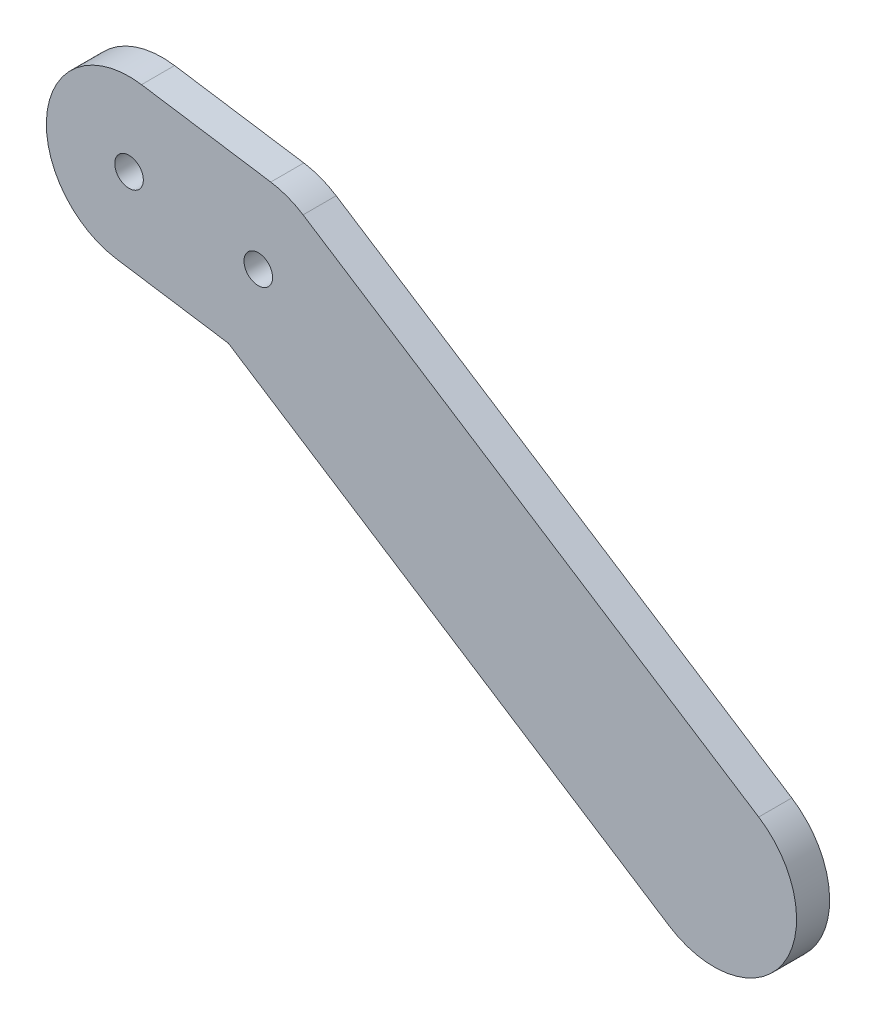
ISO-10303-21;
HEADER;
FILE_DESCRIPTION(('STEP AP214'),'2;1');
FILE_NAME('part.step','',(''),(''),'','','');
FILE_SCHEMA(('AUTOMOTIVE_DESIGN { 1 0 10303 214 1 1 1 1 }'));
ENDSEC;
DATA;
#1=APPLICATION_CONTEXT('core data for automotive mechanical design processes');
#2=APPLICATION_PROTOCOL_DEFINITION('international standard','automotive_design',2000,#1);
#3=PRODUCT_CONTEXT('',#1,'mechanical');
#4=PRODUCT('Part','Part','',(#3));
#5=PRODUCT_RELATED_PRODUCT_CATEGORY('part','',(#4));
#6=PRODUCT_DEFINITION_FORMATION('','',#4);
#7=PRODUCT_DEFINITION_CONTEXT('part definition',#1,'design');
#8=PRODUCT_DEFINITION('design','',#6,#7);
#9=PRODUCT_DEFINITION_SHAPE('','',#8);
#10=(LENGTH_UNIT() NAMED_UNIT(*) SI_UNIT(.MILLI.,.METRE.));
#11=(NAMED_UNIT(*) PLANE_ANGLE_UNIT() SI_UNIT($,.RADIAN.));
#12=(NAMED_UNIT(*) SI_UNIT($,.STERADIAN.) SOLID_ANGLE_UNIT());
#13=UNCERTAINTY_MEASURE_WITH_UNIT(LENGTH_MEASURE(1.E-05),#10,'distance_accuracy_value','');
#14=(GEOMETRIC_REPRESENTATION_CONTEXT(3) GLOBAL_UNCERTAINTY_ASSIGNED_CONTEXT((#13)) GLOBAL_UNIT_ASSIGNED_CONTEXT((#10,
#11,#12)) REPRESENTATION_CONTEXT('',''));
#15=CARTESIAN_POINT('',(0.,0.,0.));
#16=DIRECTION('',(0.,0.,1.));
#17=DIRECTION('',(1.,0.,0.));
#18=AXIS2_PLACEMENT_3D('',#15,#16,#17);
#19=CARTESIAN_POINT('',(5.41813515557909,8.40498729540258,2.));
#20=DIRECTION('',(0.541813515557907,0.840498729540255,0.));
#21=DIRECTION('',(-0.840498729540255,0.541813515557907,0.));
#22=AXIS2_PLACEMENT_3D('',#19,#20,#21);
#23=PLANE('',#22);
#24=DIRECTION('',(0.840498729540255,-0.541813515557907,0.));
#25=VECTOR('',#24,1.);
#26=CARTESIAN_POINT('',(5.41813515557909,8.40498729540258,-2.));
#27=LINE('',#26,#25);
#28=CARTESIAN_POINT('',(5.41813515557906,8.40498729540257,-2.));
#29=VERTEX_POINT('',#28);
#30=CARTESIAN_POINT('',(60.5224452158877,-27.1170889515179,-2.));
#31=VERTEX_POINT('',#30);
#32=EDGE_CURVE('E128',#29,#31,#27,.T.);
#33=ORIENTED_EDGE('',*,*,#32,.F.);
#34=DIRECTION('',(0.,0.,-1.));
#35=VECTOR('',#34,1.);
#36=CARTESIAN_POINT('',(5.41813515557906,8.40498729540257,2.));
#37=LINE('',#36,#35);
#38=CARTESIAN_POINT('',(5.41813515557906,8.40498729540257,2.));
#39=VERTEX_POINT('',#38);
#40=EDGE_CURVE('E11',#39,#29,#37,.T.);
#41=ORIENTED_EDGE('',*,*,#40,.F.);
#42=DIRECTION('',(0.840498729540255,-0.541813515557907,0.));
#43=VECTOR('',#42,1.);
#44=CARTESIAN_POINT('',(5.41813515557909,8.40498729540258,2.));
#45=LINE('',#44,#43);
#46=CARTESIAN_POINT('',(60.5224452158877,-27.1170889515179,2.));
#47=VERTEX_POINT('',#46);
#48=EDGE_CURVE('E148',#39,#47,#45,.T.);
#49=ORIENTED_EDGE('',*,*,#48,.T.);
#50=DIRECTION('',(0.,0.,-1.));
#51=VECTOR('',#50,1.);
#52=CARTESIAN_POINT('',(60.5224452158877,-27.1170889515179,2.));
#53=LINE('',#52,#51);
#54=EDGE_CURVE('E80',#47,#31,#53,.T.);
#55=ORIENTED_EDGE('',*,*,#54,.T.);
#56=EDGE_LOOP('',(#33,#41,#49,#55));
#57=FACE_BOUND('',#56,.T.);
#58=ADVANCED_FACE('F33',(#57),#23,.T.);
#59=CARTESIAN_POINT('',(0.,0.,2.));
#60=DIRECTION('',(0.,0.,-1.));
#61=DIRECTION('',(-1.,0.,0.));
#62=AXIS2_PLACEMENT_3D('',#59,#60,#61);
#63=CYLINDRICAL_SURFACE('',#62,10.);
#64=CARTESIAN_POINT('',(0.,0.,-2.));
#65=DIRECTION('',(0.,0.,1.));
#66=DIRECTION('',(1.,0.,0.));
#67=AXIS2_PLACEMENT_3D('',#64,#65,#66);
#68=CIRCLE('',#67,10.);
#69=CARTESIAN_POINT('',(1.50792779806708,9.885653936681,-2.));
#70=VERTEX_POINT('',#69);
#71=EDGE_CURVE('E131',#29,#70,#68,.T.);
#72=ORIENTED_EDGE('',*,*,#71,.T.);
#73=DIRECTION('',(0.,0.,-1.));
#74=VECTOR('',#73,1.);
#75=CARTESIAN_POINT('',(1.50792779806708,9.885653936681,2.));
#76=LINE('',#75,#74);
#77=CARTESIAN_POINT('',(1.50792779806708,9.885653936681,2.));
#78=VERTEX_POINT('',#77);
#79=EDGE_CURVE('E41',#78,#70,#76,.T.);
#80=ORIENTED_EDGE('',*,*,#79,.F.);
#81=CARTESIAN_POINT('',(0.,0.,2.));
#82=DIRECTION('',(0.,0.,1.));
#83=DIRECTION('',(1.,0.,0.));
#84=AXIS2_PLACEMENT_3D('',#81,#82,#83);
#85=CIRCLE('',#84,10.);
#86=EDGE_CURVE('E185',#39,#78,#85,.T.);
#87=ORIENTED_EDGE('',*,*,#86,.F.);
#88=ORIENTED_EDGE('',*,*,#40,.T.);
#89=EDGE_LOOP('',(#72,#80,#87,#88));
#90=FACE_BOUND('',#89,.T.);
#91=ADVANCED_FACE('F176',(#90),#63,.T.);
#92=CARTESIAN_POINT('',(1.50792779806711,9.885653936681,2.));
#93=DIRECTION('',(-0.150792779806711,-0.9885653936681,0.));
#94=DIRECTION('',(0.9885653936681,-0.150792779806711,0.));
#95=AXIS2_PLACEMENT_3D('',#92,#93,#94);
#96=PLANE('',#95);
#97=DIRECTION('',(-0.9885653936681,0.150792779806711,0.));
#98=VECTOR('',#97,1.);
#99=CARTESIAN_POINT('',(1.50792779806711,9.885653936681,-2.));
#100=LINE('',#99,#98);
#101=CARTESIAN_POINT('',(-14.125378827349,12.270311318698,-2.));
#102=VERTEX_POINT('',#101);
#103=EDGE_CURVE('E133',#70,#102,#100,.T.);
#104=ORIENTED_EDGE('',*,*,#103,.T.);
#105=DIRECTION('',(0.,0.,-1.));
#106=VECTOR('',#105,1.);
#107=CARTESIAN_POINT('',(-14.125378827349,12.270311318698,2.));
#108=LINE('',#107,#106);
#109=CARTESIAN_POINT('',(-14.125378827349,12.270311318698,2.));
#110=VERTEX_POINT('',#109);
#111=EDGE_CURVE('E152',#110,#102,#108,.T.);
#112=ORIENTED_EDGE('',*,*,#111,.F.);
#113=DIRECTION('',(-0.9885653936681,0.150792779806711,0.));
#114=VECTOR('',#113,1.);
#115=CARTESIAN_POINT('',(1.50792779806711,9.885653936681,2.));
#116=LINE('',#115,#114);
#117=EDGE_CURVE('E117',#78,#110,#116,.T.);
#118=ORIENTED_EDGE('',*,*,#117,.F.);
#119=ORIENTED_EDGE('',*,*,#79,.T.);
#120=EDGE_LOOP('',(#104,#112,#118,#119));
#121=FACE_BOUND('',#120,.T.);
#122=ADVANCED_FACE('F159',(#121),#96,.F.);
#123=CARTESIAN_POINT('',(-15.6333066254161,2.38465738201698,2.));
#124=DIRECTION('',(0.,0.,-1.));
#125=DIRECTION('',(-1.,0.,0.));
#126=AXIS2_PLACEMENT_3D('',#123,#124,#125);
#127=CYLINDRICAL_SURFACE('',#126,10.);
#128=CARTESIAN_POINT('',(-15.6333066254161,2.38465738201698,-2.));
#129=DIRECTION('',(0.,0.,1.));
#130=DIRECTION('',(1.,0.,0.));
#131=AXIS2_PLACEMENT_3D('',#128,#129,#130);
#132=CIRCLE('',#131,10.);
#133=CARTESIAN_POINT('',(-17.1412344234832,-7.50099655466402,-2.));
#134=VERTEX_POINT('',#133);
#135=EDGE_CURVE('E135',#102,#134,#132,.T.);
#136=ORIENTED_EDGE('',*,*,#135,.T.);
#137=DIRECTION('',(0.,0.,-1.));
#138=VECTOR('',#137,1.);
#139=CARTESIAN_POINT('',(-17.1412344234832,-7.50099655466402,2.));
#140=LINE('',#139,#138);
#141=CARTESIAN_POINT('',(-17.1412344234832,-7.50099655466402,2.));
#142=VERTEX_POINT('',#141);
#143=EDGE_CURVE('E105',#142,#134,#140,.T.);
#144=ORIENTED_EDGE('',*,*,#143,.F.);
#145=CARTESIAN_POINT('',(-15.6333066254161,2.38465738201698,2.));
#146=DIRECTION('',(0.,0.,1.));
#147=DIRECTION('',(1.,0.,0.));
#148=AXIS2_PLACEMENT_3D('',#145,#146,#147);
#149=CIRCLE('',#148,10.);
#150=EDGE_CURVE('E114',#110,#142,#149,.T.);
#151=ORIENTED_EDGE('',*,*,#150,.F.);
#152=ORIENTED_EDGE('',*,*,#111,.T.);
#153=EDGE_LOOP('',(#136,#144,#151,#152));
#154=FACE_BOUND('',#153,.T.);
#155=ADVANCED_FACE('F168',(#154),#127,.T.);
#156=CARTESIAN_POINT('',(-1.50792779806711,-9.885653936681,2.));
#157=DIRECTION('',(-0.150792779806711,-0.9885653936681,0.));
#158=DIRECTION('',(0.9885653936681,-0.150792779806711,0.));
#159=AXIS2_PLACEMENT_3D('',#156,#157,#158);
#160=PLANE('',#159);
#161=DIRECTION('',(-0.9885653936681,0.150792779806711,0.));
#162=VECTOR('',#161,1.);
#163=CARTESIAN_POINT('',(-1.50792779806711,-9.885653936681,-2.));
#164=LINE('',#163,#162);
#165=CARTESIAN_POINT('',(-3.62130131332809,-9.56328632278588,-2.));
#166=VERTEX_POINT('',#165);
#167=EDGE_CURVE('E104',#166,#134,#164,.T.);
#168=ORIENTED_EDGE('',*,*,#167,.F.);
#169=DIRECTION('',(0.,0.,-1.));
#170=VECTOR('',#169,1.);
#171=CARTESIAN_POINT('',(-3.62130131332809,-9.56328632278588,2.));
#172=LINE('',#171,#170);
#173=CARTESIAN_POINT('',(-3.62130131332809,-9.56328632278588,2.));
#174=VERTEX_POINT('',#173);
#175=EDGE_CURVE('E98',#174,#166,#172,.T.);
#176=ORIENTED_EDGE('',*,*,#175,.F.);
#177=DIRECTION('',(-0.9885653936681,0.150792779806711,0.));
#178=VECTOR('',#177,1.);
#179=CARTESIAN_POINT('',(-1.50792779806711,-9.885653936681,2.));
#180=LINE('',#179,#178);
#181=EDGE_CURVE('E102',#174,#142,#180,.T.);
#182=ORIENTED_EDGE('',*,*,#181,.T.);
#183=ORIENTED_EDGE('',*,*,#143,.T.);
#184=EDGE_LOOP('',(#168,#176,#182,#183));
#185=FACE_BOUND('',#184,.T.);
#186=ADVANCED_FACE('F100',(#185),#160,.T.);
#187=CARTESIAN_POINT('',(-5.41813515557905,-8.40498729540253,2.));
#188=DIRECTION('',(0.541813515557907,0.840498729540255,0.));
#189=DIRECTION('',(-0.840498729540255,0.541813515557907,0.));
#190=AXIS2_PLACEMENT_3D('',#187,#188,#189);
#191=PLANE('',#190);
#192=DIRECTION('',(0.840498729540255,-0.541813515557907,0.));
#193=VECTOR('',#192,1.);
#194=CARTESIAN_POINT('',(-5.41813515557905,-8.40498729540253,-2.));
#195=LINE('',#194,#193);
#196=CARTESIAN_POINT('',(49.6861749047295,-43.927063542323,-2.));
#197=VERTEX_POINT('',#196);
#198=EDGE_CURVE('E73',#166,#197,#195,.T.);
#199=ORIENTED_EDGE('',*,*,#198,.T.);
#200=DIRECTION('',(0.,0.,-1.));
#201=VECTOR('',#200,1.);
#202=CARTESIAN_POINT('',(49.6861749047295,-43.927063542323,2.));
#203=LINE('',#202,#201);
#204=CARTESIAN_POINT('',(49.6861749047295,-43.927063542323,2.));
#205=VERTEX_POINT('',#204);
#206=EDGE_CURVE('E106',#205,#197,#203,.T.);
#207=ORIENTED_EDGE('',*,*,#206,.F.);
#208=DIRECTION('',(0.840498729540255,-0.541813515557907,0.));
#209=VECTOR('',#208,1.);
#210=CARTESIAN_POINT('',(-5.41813515557905,-8.40498729540253,2.));
#211=LINE('',#210,#209);
#212=EDGE_CURVE('E108',#174,#205,#211,.T.);
#213=ORIENTED_EDGE('',*,*,#212,.F.);
#214=ORIENTED_EDGE('',*,*,#175,.T.);
#215=EDGE_LOOP('',(#199,#207,#213,#214));
#216=FACE_BOUND('',#215,.T.);
#217=ADVANCED_FACE('F109',(#216),#191,.F.);
#218=CARTESIAN_POINT('',(-15.6333066254161,2.38465738201698,2.));
#219=DIRECTION('',(0.,0.,-1.));
#220=DIRECTION('',(-1.,0.,0.));
#221=AXIS2_PLACEMENT_3D('',#218,#219,#220);
#222=CYLINDRICAL_SURFACE('',#221,1.73);
#223=CARTESIAN_POINT('',(-15.6333066254161,2.38465738201698,2.));
#224=DIRECTION('',(0.,0.,1.));
#225=DIRECTION('',(1.,0.,0.));
#226=AXIS2_PLACEMENT_3D('',#223,#224,#225);
#227=CIRCLE('',#226,1.73);
#228=CARTESIAN_POINT('',(-13.9033066254161,2.38465738201698,2.));
#229=VERTEX_POINT('',#228);
#230=EDGE_CURVE('E122',#229,#229,#227,.T.);
#231=ORIENTED_EDGE('',*,*,#230,.T.);
#232=EDGE_LOOP('',(#231));
#233=FACE_BOUND('',#232,.T.);
#234=CARTESIAN_POINT('',(-15.6333066254161,2.38465738201698,-2.));
#235=DIRECTION('',(0.,0.,1.));
#236=DIRECTION('',(1.,0.,0.));
#237=AXIS2_PLACEMENT_3D('',#234,#235,#236);
#238=CIRCLE('',#237,1.73);
#239=CARTESIAN_POINT('',(-13.9033066254161,2.38465738201698,-2.));
#240=VERTEX_POINT('',#239);
#241=EDGE_CURVE('E142',#240,#240,#238,.T.);
#242=ORIENTED_EDGE('',*,*,#241,.F.);
#243=EDGE_LOOP('',(#242));
#244=FACE_BOUND('',#243,.T.);
#245=ADVANCED_FACE('F190',(#233,#244),#222,.F.);
#246=CARTESIAN_POINT('',(55.1043100603086,-35.5220762469204,2.));
#247=DIRECTION('',(0.,0.,-1.));
#248=DIRECTION('',(-1.,0.,0.));
#249=AXIS2_PLACEMENT_3D('',#246,#247,#248);
#250=CYLINDRICAL_SURFACE('',#249,10.);
#251=CARTESIAN_POINT('',(55.1043100603086,-35.5220762469204,-2.));
#252=DIRECTION('',(0.,0.,1.));
#253=DIRECTION('',(1.,0.,0.));
#254=AXIS2_PLACEMENT_3D('',#251,#252,#253);
#255=CIRCLE('',#254,10.);
#256=EDGE_CURVE('E140',#197,#31,#255,.T.);
#257=ORIENTED_EDGE('',*,*,#256,.T.);
#258=ORIENTED_EDGE('',*,*,#54,.F.);
#259=CARTESIAN_POINT('',(55.1043100603086,-35.5220762469204,2.));
#260=DIRECTION('',(0.,0.,1.));
#261=DIRECTION('',(1.,0.,0.));
#262=AXIS2_PLACEMENT_3D('',#259,#260,#261);
#263=CIRCLE('',#262,10.);
#264=EDGE_CURVE('E49',#205,#47,#263,.T.);
#265=ORIENTED_EDGE('',*,*,#264,.F.);
#266=ORIENTED_EDGE('',*,*,#206,.T.);
#267=EDGE_LOOP('',(#257,#258,#265,#266));
#268=FACE_BOUND('',#267,.T.);
#269=ADVANCED_FACE('F184',(#268),#250,.T.);
#270=CARTESIAN_POINT('',(0.,0.,2.));
#271=DIRECTION('',(0.,0.,-1.));
#272=DIRECTION('',(-1.,0.,0.));
#273=AXIS2_PLACEMENT_3D('',#270,#271,#272);
#274=CYLINDRICAL_SURFACE('',#273,1.73);
#275=CARTESIAN_POINT('',(0.,0.,2.));
#276=DIRECTION('',(0.,0.,1.));
#277=DIRECTION('',(1.,0.,0.));
#278=AXIS2_PLACEMENT_3D('',#275,#276,#277);
#279=CIRCLE('',#278,1.73);
#280=CARTESIAN_POINT('',(1.73,0.,2.));
#281=VERTEX_POINT('',#280);
#282=EDGE_CURVE('E125',#281,#281,#279,.T.);
#283=ORIENTED_EDGE('',*,*,#282,.T.);
#284=EDGE_LOOP('',(#283));
#285=FACE_BOUND('',#284,.T.);
#286=CARTESIAN_POINT('',(0.,0.,-2.));
#287=DIRECTION('',(0.,0.,1.));
#288=DIRECTION('',(1.,0.,0.));
#289=AXIS2_PLACEMENT_3D('',#286,#287,#288);
#290=CIRCLE('',#289,1.73);
#291=CARTESIAN_POINT('',(1.73,0.,-2.));
#292=VERTEX_POINT('',#291);
#293=EDGE_CURVE('E145',#292,#292,#290,.T.);
#294=ORIENTED_EDGE('',*,*,#293,.F.);
#295=EDGE_LOOP('',(#294));
#296=FACE_BOUND('',#295,.T.);
#297=ADVANCED_FACE('F189',(#285,#296),#274,.F.);
#298=CARTESIAN_POINT('',(0.,0.,2.));
#299=DIRECTION('',(0.,0.,1.));
#300=DIRECTION('',(1.,0.,0.));
#301=AXIS2_PLACEMENT_3D('',#298,#299,#300);
#302=PLANE('',#301);
#303=ORIENTED_EDGE('',*,*,#48,.F.);
#304=ORIENTED_EDGE('',*,*,#86,.T.);
#305=ORIENTED_EDGE('',*,*,#117,.T.);
#306=ORIENTED_EDGE('',*,*,#150,.T.);
#307=ORIENTED_EDGE('',*,*,#181,.F.);
#308=ORIENTED_EDGE('',*,*,#212,.T.);
#309=ORIENTED_EDGE('',*,*,#264,.T.);
#310=EDGE_LOOP('',(#303,#304,#305,#306,#307,#308,#309));
#311=FACE_BOUND('',#310,.T.);
#312=ORIENTED_EDGE('',*,*,#230,.F.);
#313=EDGE_LOOP('',(#312));
#314=FACE_BOUND('',#313,.T.);
#315=ORIENTED_EDGE('',*,*,#282,.F.);
#316=EDGE_LOOP('',(#315));
#317=FACE_BOUND('',#316,.T.);
#318=ADVANCED_FACE('F111',(#311,#314,#317),#302,.T.);
#319=CARTESIAN_POINT('',(0.,0.,-2.));
#320=DIRECTION('',(0.,0.,1.));
#321=DIRECTION('',(1.,0.,0.));
#322=AXIS2_PLACEMENT_3D('',#319,#320,#321);
#323=PLANE('',#322);
#324=ORIENTED_EDGE('',*,*,#32,.T.);
#325=ORIENTED_EDGE('',*,*,#256,.F.);
#326=ORIENTED_EDGE('',*,*,#198,.F.);
#327=ORIENTED_EDGE('',*,*,#167,.T.);
#328=ORIENTED_EDGE('',*,*,#135,.F.);
#329=ORIENTED_EDGE('',*,*,#103,.F.);
#330=ORIENTED_EDGE('',*,*,#71,.F.);
#331=EDGE_LOOP('',(#324,#325,#326,#327,#328,#329,#330));
#332=FACE_BOUND('',#331,.T.);
#333=ORIENTED_EDGE('',*,*,#241,.T.);
#334=EDGE_LOOP('',(#333));
#335=FACE_BOUND('',#334,.T.);
#336=ORIENTED_EDGE('',*,*,#293,.T.);
#337=EDGE_LOOP('',(#336));
#338=FACE_BOUND('',#337,.T.);
#339=ADVANCED_FACE('F165',(#332,#335,#338),#323,.F.);
#340=CLOSED_SHELL('',(#58,#91,#122,#155,#186,#217,#245,#269,#297,#318,#339));
#341=MANIFOLD_SOLID_BREP('B2',#340);
#342=ADVANCED_BREP_SHAPE_REPRESENTATION('',(#18,#341),#14);
#343=SHAPE_DEFINITION_REPRESENTATION(#9,#342);
ENDSEC;
END-ISO-10303-21;
